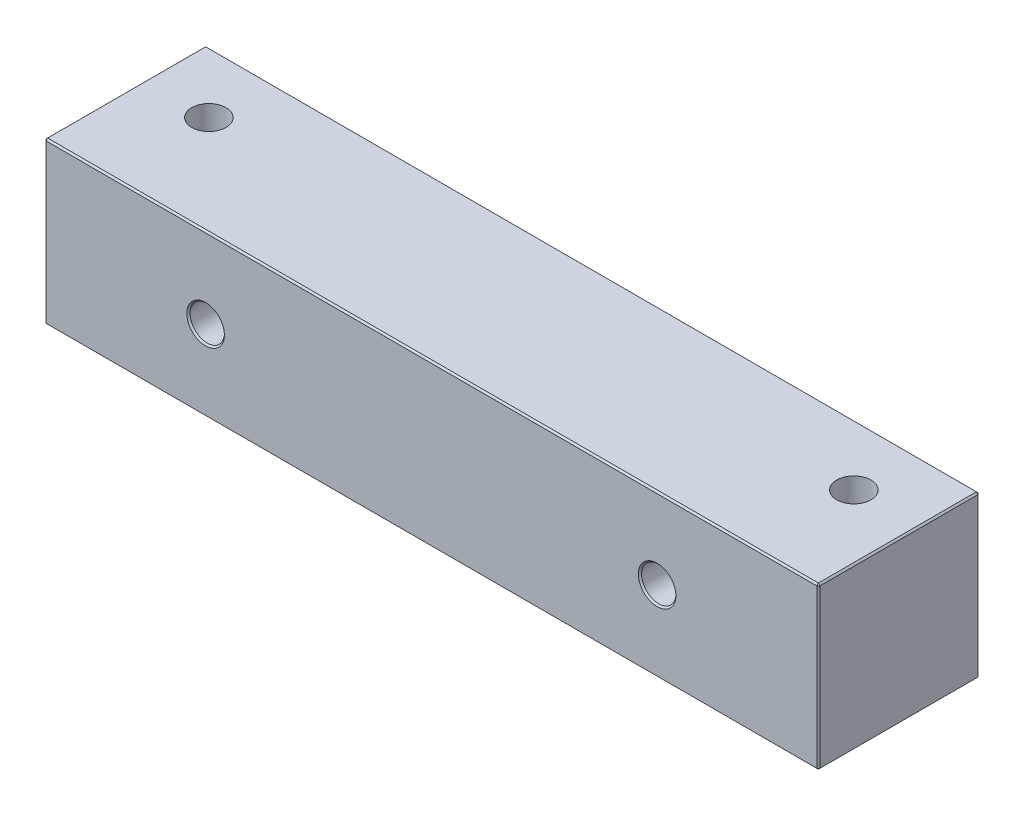
ISO-10303-21;
HEADER;
FILE_DESCRIPTION(('STEP AP214'),'2;1');
FILE_NAME('part.step','',(''),(''),'','','');
FILE_SCHEMA(('AUTOMOTIVE_DESIGN { 1 0 10303 214 1 1 1 1 }'));
ENDSEC;
DATA;
#1=APPLICATION_CONTEXT('core data for automotive mechanical design processes');
#2=APPLICATION_PROTOCOL_DEFINITION('international standard','automotive_design',2000,#1);
#3=PRODUCT_CONTEXT('',#1,'mechanical');
#4=PRODUCT('Part','Part','',(#3));
#5=PRODUCT_RELATED_PRODUCT_CATEGORY('part','',(#4));
#6=PRODUCT_DEFINITION_FORMATION('','',#4);
#7=PRODUCT_DEFINITION_CONTEXT('part definition',#1,'design');
#8=PRODUCT_DEFINITION('design','',#6,#7);
#9=PRODUCT_DEFINITION_SHAPE('','',#8);
#10=(LENGTH_UNIT() NAMED_UNIT(*) SI_UNIT(.MILLI.,.METRE.));
#11=(NAMED_UNIT(*) PLANE_ANGLE_UNIT() SI_UNIT($,.RADIAN.));
#12=(NAMED_UNIT(*) SI_UNIT($,.STERADIAN.) SOLID_ANGLE_UNIT());
#13=UNCERTAINTY_MEASURE_WITH_UNIT(LENGTH_MEASURE(1.E-05),#10,'distance_accuracy_value','');
#14=(GEOMETRIC_REPRESENTATION_CONTEXT(3) GLOBAL_UNCERTAINTY_ASSIGNED_CONTEXT((#13)) GLOBAL_UNIT_ASSIGNED_CONTEXT((#10,
#11,#12)) REPRESENTATION_CONTEXT('',''));
#15=CARTESIAN_POINT('',(0.,0.,0.));
#16=DIRECTION('',(0.,0.,1.));
#17=DIRECTION('',(1.,0.,0.));
#18=AXIS2_PLACEMENT_3D('',#15,#16,#17);
#19=CARTESIAN_POINT('',(30.48,6.35,-6.35));
#20=DIRECTION('',(-1.,0.,0.));
#21=DIRECTION('',(0.,0.,1.));
#22=AXIS2_PLACEMENT_3D('',#19,#20,#21);
#23=PLANE('',#22);
#24=DIRECTION('',(0.,0.,-1.));
#25=VECTOR('',#24,1.);
#26=CARTESIAN_POINT('',(30.48,-6.223,-6.35));
#27=LINE('',#26,#25);
#28=CARTESIAN_POINT('',(30.48,-6.223,6.223));
#29=VERTEX_POINT('',#28);
#30=CARTESIAN_POINT('',(30.48,-6.223,-6.223));
#31=VERTEX_POINT('',#30);
#32=EDGE_CURVE('E208',#29,#31,#27,.T.);
#33=ORIENTED_EDGE('',*,*,#32,.T.);
#34=DIRECTION('',(0.,1.,0.));
#35=VECTOR('',#34,1.);
#36=CARTESIAN_POINT('',(30.48,6.35,-6.223));
#37=LINE('',#36,#35);
#38=CARTESIAN_POINT('',(30.48,6.223,-6.223));
#39=VERTEX_POINT('',#38);
#40=EDGE_CURVE('E146',#31,#39,#37,.T.);
#41=ORIENTED_EDGE('',*,*,#40,.T.);
#42=DIRECTION('',(0.,0.,1.));
#43=VECTOR('',#42,1.);
#44=CARTESIAN_POINT('',(30.48,6.223,6.35));
#45=LINE('',#44,#43);
#46=CARTESIAN_POINT('',(30.48,6.223,6.223));
#47=VERTEX_POINT('',#46);
#48=EDGE_CURVE('E210',#39,#47,#45,.T.);
#49=ORIENTED_EDGE('',*,*,#48,.T.);
#50=DIRECTION('',(0.,-1.,0.));
#51=VECTOR('',#50,1.);
#52=CARTESIAN_POINT('',(30.48,6.35,6.223));
#53=LINE('',#52,#51);
#54=EDGE_CURVE('E206',#47,#29,#53,.T.);
#55=ORIENTED_EDGE('',*,*,#54,.T.);
#56=EDGE_LOOP('',(#33,#41,#49,#55));
#57=FACE_BOUND('',#56,.T.);
#58=ADVANCED_FACE('F50',(#57),#23,.F.);
#59=CARTESIAN_POINT('',(-30.48,6.35,-6.35));
#60=DIRECTION('',(0.,0.,1.));
#61=DIRECTION('',(1.,0.,0.));
#62=AXIS2_PLACEMENT_3D('',#59,#60,#61);
#63=PLANE('',#62);
#64=CARTESIAN_POINT('',(17.78,0.,-6.35));
#65=DIRECTION('',(0.,0.,1.));
#66=DIRECTION('',(1.,0.,0.));
#67=AXIS2_PLACEMENT_3D('',#64,#65,#66);
#68=CIRCLE('',#67,1.47955);
#69=CARTESIAN_POINT('',(19.25955,0.,-6.35));
#70=VERTEX_POINT('',#69);
#71=EDGE_CURVE('E178',#70,#70,#68,.T.);
#72=ORIENTED_EDGE('',*,*,#71,.T.);
#73=EDGE_LOOP('',(#72));
#74=FACE_BOUND('',#73,.T.);
#75=CARTESIAN_POINT('',(-17.78,0.,-6.35));
#76=DIRECTION('',(0.,0.,1.));
#77=DIRECTION('',(1.,0.,0.));
#78=AXIS2_PLACEMENT_3D('',#75,#76,#77);
#79=CIRCLE('',#78,1.47955000000002);
#80=CARTESIAN_POINT('',(-16.30045,0.,-6.35));
#81=VERTEX_POINT('',#80);
#82=EDGE_CURVE('E175',#81,#81,#79,.T.);
#83=ORIENTED_EDGE('',*,*,#82,.T.);
#84=EDGE_LOOP('',(#83));
#85=FACE_BOUND('',#84,.T.);
#86=DIRECTION('',(1.,0.,0.));
#87=VECTOR('',#86,1.);
#88=CARTESIAN_POINT('',(30.48,6.223,-6.35));
#89=LINE('',#88,#87);
#90=CARTESIAN_POINT('',(-30.353,6.223,-6.35));
#91=VERTEX_POINT('',#90);
#92=CARTESIAN_POINT('',(30.353,6.223,-6.35));
#93=VERTEX_POINT('',#92);
#94=EDGE_CURVE('E174',#91,#93,#89,.T.);
#95=ORIENTED_EDGE('',*,*,#94,.T.);
#96=DIRECTION('',(0.,-1.,0.));
#97=VECTOR('',#96,1.);
#98=CARTESIAN_POINT('',(30.353,6.35,-6.35));
#99=LINE('',#98,#97);
#100=CARTESIAN_POINT('',(30.353,-6.223,-6.35));
#101=VERTEX_POINT('',#100);
#102=EDGE_CURVE('E144',#93,#101,#99,.T.);
#103=ORIENTED_EDGE('',*,*,#102,.T.);
#104=DIRECTION('',(-1.,0.,0.));
#105=VECTOR('',#104,1.);
#106=CARTESIAN_POINT('',(-30.48,-6.223,-6.35));
#107=LINE('',#106,#105);
#108=CARTESIAN_POINT('',(-30.353,-6.223,-6.35));
#109=VERTEX_POINT('',#108);
#110=EDGE_CURVE('E163',#101,#109,#107,.T.);
#111=ORIENTED_EDGE('',*,*,#110,.T.);
#112=DIRECTION('',(0.,1.,0.));
#113=VECTOR('',#112,1.);
#114=CARTESIAN_POINT('',(-30.353,6.35,-6.35));
#115=LINE('',#114,#113);
#116=EDGE_CURVE('E169',#109,#91,#115,.T.);
#117=ORIENTED_EDGE('',*,*,#116,.T.);
#118=EDGE_LOOP('',(#95,#103,#111,#117));
#119=FACE_BOUND('',#118,.T.);
#120=ADVANCED_FACE('F172',(#74,#85,#119),#63,.F.);
#121=CARTESIAN_POINT('',(-30.48,6.35,-6.35));
#122=DIRECTION('',(1.,0.,0.));
#123=DIRECTION('',(0.,0.,-1.));
#124=AXIS2_PLACEMENT_3D('',#121,#122,#123);
#125=PLANE('',#124);
#126=DIRECTION('',(0.,1.,0.));
#127=VECTOR('',#126,1.);
#128=CARTESIAN_POINT('',(-30.48,6.35,6.223));
#129=LINE('',#128,#127);
#130=CARTESIAN_POINT('',(-30.48,-6.223,6.223));
#131=VERTEX_POINT('',#130);
#132=CARTESIAN_POINT('',(-30.48,6.223,6.223));
#133=VERTEX_POINT('',#132);
#134=EDGE_CURVE('E223',#131,#133,#129,.T.);
#135=ORIENTED_EDGE('',*,*,#134,.T.);
#136=DIRECTION('',(0.,0.,-1.));
#137=VECTOR('',#136,1.);
#138=CARTESIAN_POINT('',(-30.48,6.223,-6.35));
#139=LINE('',#138,#137);
#140=CARTESIAN_POINT('',(-30.48,6.223,-6.223));
#141=VERTEX_POINT('',#140);
#142=EDGE_CURVE('E229',#133,#141,#139,.T.);
#143=ORIENTED_EDGE('',*,*,#142,.T.);
#144=DIRECTION('',(0.,-1.,0.));
#145=VECTOR('',#144,1.);
#146=CARTESIAN_POINT('',(-30.48,6.35,-6.223));
#147=LINE('',#146,#145);
#148=CARTESIAN_POINT('',(-30.48,-6.223,-6.223));
#149=VERTEX_POINT('',#148);
#150=EDGE_CURVE('E227',#141,#149,#147,.T.);
#151=ORIENTED_EDGE('',*,*,#150,.T.);
#152=DIRECTION('',(0.,0.,1.));
#153=VECTOR('',#152,1.);
#154=CARTESIAN_POINT('',(-30.48,-6.223,-6.35));
#155=LINE('',#154,#153);
#156=EDGE_CURVE('E225',#149,#131,#155,.T.);
#157=ORIENTED_EDGE('',*,*,#156,.T.);
#158=EDGE_LOOP('',(#135,#143,#151,#157));
#159=FACE_BOUND('',#158,.T.);
#160=ADVANCED_FACE('F365',(#159),#125,.F.);
#161=CARTESIAN_POINT('',(-30.48,6.35,6.35));
#162=DIRECTION('',(0.,0.,-1.));
#163=DIRECTION('',(-1.,0.,0.));
#164=AXIS2_PLACEMENT_3D('',#161,#162,#163);
#165=PLANE('',#164);
#166=DIRECTION('',(-1.,0.,0.));
#167=VECTOR('',#166,1.);
#168=CARTESIAN_POINT('',(-30.48,6.223,6.35));
#169=LINE('',#168,#167);
#170=CARTESIAN_POINT('',(30.353,6.223,6.35));
#171=VERTEX_POINT('',#170);
#172=CARTESIAN_POINT('',(-30.353,6.223,6.35));
#173=VERTEX_POINT('',#172);
#174=EDGE_CURVE('E59',#171,#173,#169,.T.);
#175=ORIENTED_EDGE('',*,*,#174,.T.);
#176=DIRECTION('',(0.,-1.,0.));
#177=VECTOR('',#176,1.);
#178=CARTESIAN_POINT('',(-30.353,6.35,6.35));
#179=LINE('',#178,#177);
#180=CARTESIAN_POINT('',(-30.353,-6.223,6.35));
#181=VERTEX_POINT('',#180);
#182=EDGE_CURVE('E13',#173,#181,#179,.T.);
#183=ORIENTED_EDGE('',*,*,#182,.T.);
#184=DIRECTION('',(1.,0.,0.));
#185=VECTOR('',#184,1.);
#186=CARTESIAN_POINT('',(-30.48,-6.223,6.35));
#187=LINE('',#186,#185);
#188=CARTESIAN_POINT('',(30.353,-6.223,6.35));
#189=VERTEX_POINT('',#188);
#190=EDGE_CURVE('E238',#181,#189,#187,.T.);
#191=ORIENTED_EDGE('',*,*,#190,.T.);
#192=DIRECTION('',(0.,1.,0.));
#193=VECTOR('',#192,1.);
#194=CARTESIAN_POINT('',(30.353,6.35,6.35));
#195=LINE('',#194,#193);
#196=EDGE_CURVE('E70',#189,#171,#195,.T.);
#197=ORIENTED_EDGE('',*,*,#196,.T.);
#198=EDGE_LOOP('',(#175,#183,#191,#197));
#199=FACE_BOUND('',#198,.T.);
#200=CARTESIAN_POINT('',(17.78,0.,6.35));
#201=DIRECTION('',(0.,0.,-1.));
#202=DIRECTION('',(-1.,0.,0.));
#203=AXIS2_PLACEMENT_3D('',#200,#201,#202);
#204=CIRCLE('',#203,1.47954999999998);
#205=CARTESIAN_POINT('',(16.30045,0.,6.35));
#206=VERTEX_POINT('',#205);
#207=EDGE_CURVE('E235',#206,#206,#204,.T.);
#208=ORIENTED_EDGE('',*,*,#207,.T.);
#209=EDGE_LOOP('',(#208));
#210=FACE_BOUND('',#209,.T.);
#211=CARTESIAN_POINT('',(-17.78,0.,6.35));
#212=DIRECTION('',(0.,0.,-1.));
#213=DIRECTION('',(-1.,0.,0.));
#214=AXIS2_PLACEMENT_3D('',#211,#212,#213);
#215=CIRCLE('',#214,1.47955);
#216=CARTESIAN_POINT('',(-19.25955,0.,6.35));
#217=VERTEX_POINT('',#216);
#218=EDGE_CURVE('E232',#217,#217,#215,.T.);
#219=ORIENTED_EDGE('',*,*,#218,.T.);
#220=EDGE_LOOP('',(#219));
#221=FACE_BOUND('',#220,.T.);
#222=ADVANCED_FACE('F428',(#199,#210,#221),#165,.F.);
#223=CARTESIAN_POINT('',(0.,6.35,0.));
#224=DIRECTION('',(0.,1.,0.));
#225=DIRECTION('',(0.,0.,1.));
#226=AXIS2_PLACEMENT_3D('',#223,#224,#225);
#227=PLANE('',#226);
#228=DIRECTION('',(0.,0.,-1.));
#229=VECTOR('',#228,1.);
#230=CARTESIAN_POINT('',(30.353,6.35,-6.35));
#231=LINE('',#230,#229);
#232=CARTESIAN_POINT('',(30.353,6.35,6.223));
#233=VERTEX_POINT('',#232);
#234=CARTESIAN_POINT('',(30.353,6.35,-6.223));
#235=VERTEX_POINT('',#234);
#236=EDGE_CURVE('E201',#233,#235,#231,.T.);
#237=ORIENTED_EDGE('',*,*,#236,.T.);
#238=DIRECTION('',(-1.,0.,0.));
#239=VECTOR('',#238,1.);
#240=CARTESIAN_POINT('',(-30.48,6.35,-6.223));
#241=LINE('',#240,#239);
#242=CARTESIAN_POINT('',(-30.353,6.35,-6.223));
#243=VERTEX_POINT('',#242);
#244=EDGE_CURVE('E204',#235,#243,#241,.T.);
#245=ORIENTED_EDGE('',*,*,#244,.T.);
#246=DIRECTION('',(0.,0.,1.));
#247=VECTOR('',#246,1.);
#248=CARTESIAN_POINT('',(-30.353,6.35,6.35));
#249=LINE('',#248,#247);
#250=CARTESIAN_POINT('',(-30.353,6.35,6.223));
#251=VERTEX_POINT('',#250);
#252=EDGE_CURVE('E199',#243,#251,#249,.T.);
#253=ORIENTED_EDGE('',*,*,#252,.T.);
#254=DIRECTION('',(1.,0.,0.));
#255=VECTOR('',#254,1.);
#256=CARTESIAN_POINT('',(30.48,6.35,6.223));
#257=LINE('',#256,#255);
#258=EDGE_CURVE('E197',#251,#233,#257,.T.);
#259=ORIENTED_EDGE('',*,*,#258,.T.);
#260=EDGE_LOOP('',(#237,#245,#253,#259));
#261=FACE_BOUND('',#260,.T.);
#262=CARTESIAN_POINT('',(-25.4,6.35,-1.524));
#263=DIRECTION('',(0.,1.,0.));
#264=DIRECTION('',(0.,0.,1.));
#265=AXIS2_PLACEMENT_3D('',#262,#263,#264);
#266=CIRCLE('',#265,1.35254999999999);
#267=CARTESIAN_POINT('',(-25.4,6.35,-0.171450000000013));
#268=VERTEX_POINT('',#267);
#269=EDGE_CURVE('E295',#268,#268,#266,.T.);
#270=ORIENTED_EDGE('',*,*,#269,.F.);
#271=EDGE_LOOP('',(#270));
#272=FACE_BOUND('',#271,.T.);
#273=CARTESIAN_POINT('',(25.4,6.35,-1.52400000000002));
#274=DIRECTION('',(0.,1.,0.));
#275=DIRECTION('',(0.,0.,1.));
#276=AXIS2_PLACEMENT_3D('',#273,#274,#275);
#277=CIRCLE('',#276,1.35254999999999);
#278=CARTESIAN_POINT('',(25.4,6.35,-0.171450000000037));
#279=VERTEX_POINT('',#278);
#280=EDGE_CURVE('E306',#279,#279,#277,.T.);
#281=ORIENTED_EDGE('',*,*,#280,.F.);
#282=EDGE_LOOP('',(#281));
#283=FACE_BOUND('',#282,.T.);
#284=ADVANCED_FACE('F444',(#261,#272,#283),#227,.T.);
#285=CARTESIAN_POINT('',(0.,-6.35,0.));
#286=DIRECTION('',(0.,1.,0.));
#287=DIRECTION('',(0.,0.,1.));
#288=AXIS2_PLACEMENT_3D('',#285,#286,#287);
#289=PLANE('',#288);
#290=DIRECTION('',(1.,0.,0.));
#291=VECTOR('',#290,1.);
#292=CARTESIAN_POINT('',(0.,-6.35,-6.223));
#293=LINE('',#292,#291);
#294=CARTESIAN_POINT('',(-30.353,-6.35,-6.223));
#295=VERTEX_POINT('',#294);
#296=CARTESIAN_POINT('',(30.353,-6.35,-6.223));
#297=VERTEX_POINT('',#296);
#298=EDGE_CURVE('E218',#295,#297,#293,.T.);
#299=ORIENTED_EDGE('',*,*,#298,.T.);
#300=DIRECTION('',(0.,0.,1.));
#301=VECTOR('',#300,1.);
#302=CARTESIAN_POINT('',(30.353,-6.35,0.));
#303=LINE('',#302,#301);
#304=CARTESIAN_POINT('',(30.353,-6.35,6.223));
#305=VERTEX_POINT('',#304);
#306=EDGE_CURVE('E220',#297,#305,#303,.T.);
#307=ORIENTED_EDGE('',*,*,#306,.T.);
#308=DIRECTION('',(-1.,0.,0.));
#309=VECTOR('',#308,1.);
#310=CARTESIAN_POINT('',(0.,-6.35,6.223));
#311=LINE('',#310,#309);
#312=CARTESIAN_POINT('',(-30.353,-6.35,6.223));
#313=VERTEX_POINT('',#312);
#314=EDGE_CURVE('E214',#305,#313,#311,.T.);
#315=ORIENTED_EDGE('',*,*,#314,.T.);
#316=DIRECTION('',(0.,0.,-1.));
#317=VECTOR('',#316,1.);
#318=CARTESIAN_POINT('',(-30.353,-6.35,0.));
#319=LINE('',#318,#317);
#320=EDGE_CURVE('E216',#313,#295,#319,.T.);
#321=ORIENTED_EDGE('',*,*,#320,.T.);
#322=EDGE_LOOP('',(#299,#307,#315,#321));
#323=FACE_BOUND('',#322,.T.);
#324=CARTESIAN_POINT('',(-25.4,-6.35,-1.524));
#325=DIRECTION('',(0.,1.,0.));
#326=DIRECTION('',(0.,0.,1.));
#327=AXIS2_PLACEMENT_3D('',#324,#325,#326);
#328=CIRCLE('',#327,1.35254999999999);
#329=CARTESIAN_POINT('',(-25.4,-6.35,-0.171450000000013));
#330=VERTEX_POINT('',#329);
#331=EDGE_CURVE('E301',#330,#330,#328,.T.);
#332=ORIENTED_EDGE('',*,*,#331,.T.);
#333=EDGE_LOOP('',(#332));
#334=FACE_BOUND('',#333,.T.);
#335=CARTESIAN_POINT('',(25.4,-6.35,-1.52400000000002));
#336=DIRECTION('',(0.,1.,0.));
#337=DIRECTION('',(0.,0.,1.));
#338=AXIS2_PLACEMENT_3D('',#335,#336,#337);
#339=CIRCLE('',#338,1.35254999999999);
#340=CARTESIAN_POINT('',(25.4,-6.35,-0.171450000000037));
#341=VERTEX_POINT('',#340);
#342=EDGE_CURVE('E170',#341,#341,#339,.T.);
#343=ORIENTED_EDGE('',*,*,#342,.T.);
#344=EDGE_LOOP('',(#343));
#345=FACE_BOUND('',#344,.T.);
#346=ADVANCED_FACE('F341',(#323,#334,#345),#289,.F.);
#347=CARTESIAN_POINT('',(25.4,6.35,-1.52400000000002));
#348=DIRECTION('',(0.,1.,0.));
#349=DIRECTION('',(0.,0.,1.));
#350=AXIS2_PLACEMENT_3D('',#347,#348,#349);
#351=CYLINDRICAL_SURFACE('',#350,1.35254999999999);
#352=ORIENTED_EDGE('',*,*,#342,.F.);
#353=EDGE_LOOP('',(#352));
#354=FACE_BOUND('',#353,.T.);
#355=ORIENTED_EDGE('',*,*,#280,.T.);
#356=EDGE_LOOP('',(#355));
#357=FACE_BOUND('',#356,.T.);
#358=ADVANCED_FACE('F449',(#354,#357),#351,.F.);
#359=CARTESIAN_POINT('',(-25.4,6.35,-1.524));
#360=DIRECTION('',(0.,1.,0.));
#361=DIRECTION('',(0.,0.,1.));
#362=AXIS2_PLACEMENT_3D('',#359,#360,#361);
#363=CYLINDRICAL_SURFACE('',#362,1.35254999999999);
#364=ORIENTED_EDGE('',*,*,#331,.F.);
#365=EDGE_LOOP('',(#364));
#366=FACE_BOUND('',#365,.T.);
#367=ORIENTED_EDGE('',*,*,#269,.T.);
#368=EDGE_LOOP('',(#367));
#369=FACE_BOUND('',#368,.T.);
#370=ADVANCED_FACE('F455',(#366,#369),#363,.F.);
#371=CARTESIAN_POINT('',(17.78,0.,6.35));
#372=DIRECTION('',(0.,0.,1.));
#373=DIRECTION('',(1.,0.,0.));
#374=AXIS2_PLACEMENT_3D('',#371,#372,#373);
#375=CYLINDRICAL_SURFACE('',#374,1.35254999999999);
#376=CARTESIAN_POINT('',(17.78,0.,-6.22299999999999));
#377=DIRECTION('',(0.,0.,1.));
#378=DIRECTION('',(1.,0.,0.));
#379=AXIS2_PLACEMENT_3D('',#376,#377,#378);
#380=CIRCLE('',#379,1.35254999999999);
#381=CARTESIAN_POINT('',(19.13255,0.,-6.22299999999999));
#382=VERTEX_POINT('',#381);
#383=EDGE_CURVE('E188',#382,#382,#380,.F.);
#384=ORIENTED_EDGE('',*,*,#383,.T.);
#385=EDGE_LOOP('',(#384));
#386=FACE_BOUND('',#385,.T.);
#387=CARTESIAN_POINT('',(17.78,0.,6.22300000000002));
#388=DIRECTION('',(0.,0.,-1.));
#389=DIRECTION('',(-1.,0.,0.));
#390=AXIS2_PLACEMENT_3D('',#387,#388,#389);
#391=CIRCLE('',#390,1.35254999999999);
#392=CARTESIAN_POINT('',(16.42745,0.,6.22300000000002));
#393=VERTEX_POINT('',#392);
#394=EDGE_CURVE('E185',#393,#393,#391,.F.);
#395=ORIENTED_EDGE('',*,*,#394,.T.);
#396=EDGE_LOOP('',(#395));
#397=FACE_BOUND('',#396,.T.);
#398=ADVANCED_FACE('F459',(#386,#397),#375,.F.);
#399=CARTESIAN_POINT('',(-17.78,0.,6.35));
#400=DIRECTION('',(0.,0.,1.));
#401=DIRECTION('',(1.,0.,0.));
#402=AXIS2_PLACEMENT_3D('',#399,#400,#401);
#403=CYLINDRICAL_SURFACE('',#402,1.35254999999999);
#404=CARTESIAN_POINT('',(-17.78,0.,-6.22299999999997));
#405=DIRECTION('',(0.,0.,1.));
#406=DIRECTION('',(1.,0.,0.));
#407=AXIS2_PLACEMENT_3D('',#404,#405,#406);
#408=CIRCLE('',#407,1.35254999999999);
#409=CARTESIAN_POINT('',(-16.42745,0.,-6.22299999999997));
#410=VERTEX_POINT('',#409);
#411=EDGE_CURVE('E194',#410,#410,#408,.F.);
#412=ORIENTED_EDGE('',*,*,#411,.T.);
#413=EDGE_LOOP('',(#412));
#414=FACE_BOUND('',#413,.T.);
#415=CARTESIAN_POINT('',(-17.78,0.,6.223));
#416=DIRECTION('',(0.,0.,-1.));
#417=DIRECTION('',(-1.,0.,0.));
#418=AXIS2_PLACEMENT_3D('',#415,#416,#417);
#419=CIRCLE('',#418,1.35254999999999);
#420=CARTESIAN_POINT('',(-19.13255,0.,6.223));
#421=VERTEX_POINT('',#420);
#422=EDGE_CURVE('E191',#421,#421,#419,.F.);
#423=ORIENTED_EDGE('',*,*,#422,.T.);
#424=EDGE_LOOP('',(#423));
#425=FACE_BOUND('',#424,.T.);
#426=ADVANCED_FACE('F374',(#414,#425),#403,.F.);
#427=CARTESIAN_POINT('',(17.78,0.,-6.35));
#428=DIRECTION('',(0.,0.,-1.));
#429=DIRECTION('',(-1.,0.,0.));
#430=AXIS2_PLACEMENT_3D('',#427,#428,#429);
#431=CONICAL_SURFACE('',#430,1.47955,0.785398163397455);
#432=ORIENTED_EDGE('',*,*,#383,.F.);
#433=EDGE_LOOP('',(#432));
#434=FACE_BOUND('',#433,.T.);
#435=ORIENTED_EDGE('',*,*,#71,.F.);
#436=EDGE_LOOP('',(#435));
#437=FACE_BOUND('',#436,.T.);
#438=ADVANCED_FACE('F370',(#434,#437),#431,.F.);
#439=CARTESIAN_POINT('',(-17.78,0.,-6.35));
#440=DIRECTION('',(0.,0.,-1.));
#441=DIRECTION('',(-1.,0.,0.));
#442=AXIS2_PLACEMENT_3D('',#439,#440,#441);
#443=CONICAL_SURFACE('',#442,1.47955000000002,0.785398163397455);
#444=ORIENTED_EDGE('',*,*,#411,.F.);
#445=EDGE_LOOP('',(#444));
#446=FACE_BOUND('',#445,.T.);
#447=ORIENTED_EDGE('',*,*,#82,.F.);
#448=EDGE_LOOP('',(#447));
#449=FACE_BOUND('',#448,.T.);
#450=ADVANCED_FACE('F373',(#446,#449),#443,.F.);
#451=CARTESIAN_POINT('',(-30.48,-6.223,-6.35));
#452=DIRECTION('',(0.707106781186547,0.707106781186547,0.));
#453=DIRECTION('',(0.,0.,1.));
#454=AXIS2_PLACEMENT_3D('',#451,#452,#453);
#455=PLANE('',#454);
#456=DIRECTION('',(-0.707106781186547,0.707106781186547,0.));
#457=VECTOR('',#456,1.);
#458=CARTESIAN_POINT('',(-30.48,-6.223,6.223));
#459=LINE('',#458,#457);
#460=EDGE_CURVE('E54',#131,#313,#459,.F.);
#461=ORIENTED_EDGE('',*,*,#460,.F.);
#462=ORIENTED_EDGE('',*,*,#156,.F.);
#463=DIRECTION('',(0.707106781186547,-0.707106781186547,0.));
#464=VECTOR('',#463,1.);
#465=CARTESIAN_POINT('',(-30.48,-6.223,-6.223));
#466=LINE('',#465,#464);
#467=EDGE_CURVE('E290',#295,#149,#466,.F.);
#468=ORIENTED_EDGE('',*,*,#467,.F.);
#469=ORIENTED_EDGE('',*,*,#320,.F.);
#470=EDGE_LOOP('',(#461,#462,#468,#469));
#471=FACE_BOUND('',#470,.T.);
#472=ADVANCED_FACE('F346',(#471),#455,.F.);
#473=CARTESIAN_POINT('',(-30.48,-6.223,6.223));
#474=DIRECTION('',(-0.577350269189626,-0.577350269189626,0.577350269189626));
#475=DIRECTION('',(0.707106781186547,0.,0.707106781186547));
#476=AXIS2_PLACEMENT_3D('',#473,#474,#475);
#477=PLANE('',#476);
#478=DIRECTION('',(0.707106781186547,0.,0.707106781186547));
#479=VECTOR('',#478,1.);
#480=CARTESIAN_POINT('',(-30.48,-6.223,6.223));
#481=LINE('',#480,#479);
#482=EDGE_CURVE('E285',#131,#181,#481,.T.);
#483=ORIENTED_EDGE('',*,*,#482,.F.);
#484=ORIENTED_EDGE('',*,*,#460,.T.);
#485=DIRECTION('',(0.,-0.707106781186547,-0.707106781186547));
#486=VECTOR('',#485,1.);
#487=CARTESIAN_POINT('',(-30.353,-6.2865,6.2865));
#488=LINE('',#487,#486);
#489=EDGE_CURVE('E288',#181,#313,#488,.T.);
#490=ORIENTED_EDGE('',*,*,#489,.F.);
#491=EDGE_LOOP('',(#483,#484,#490));
#492=FACE_BOUND('',#491,.T.);
#493=ADVANCED_FACE('F350',(#492),#477,.T.);
#494=CARTESIAN_POINT('',(-30.48,-6.223,-6.223));
#495=DIRECTION('',(-0.577350269189626,-0.577350269189626,-0.577350269189626));
#496=DIRECTION('',(-0.707106781186547,0.,0.707106781186547));
#497=AXIS2_PLACEMENT_3D('',#494,#495,#496);
#498=PLANE('',#497);
#499=DIRECTION('',(0.,0.707106781186547,-0.707106781186547));
#500=VECTOR('',#499,1.);
#501=CARTESIAN_POINT('',(-30.353,-6.2865,-6.2865));
#502=LINE('',#501,#500);
#503=EDGE_CURVE('E166',#295,#109,#502,.T.);
#504=ORIENTED_EDGE('',*,*,#503,.F.);
#505=ORIENTED_EDGE('',*,*,#467,.T.);
#506=DIRECTION('',(-0.707106781186547,0.,0.707106781186547));
#507=VECTOR('',#506,1.);
#508=CARTESIAN_POINT('',(-30.48,-6.223,-6.223));
#509=LINE('',#508,#507);
#510=EDGE_CURVE('E282',#109,#149,#509,.T.);
#511=ORIENTED_EDGE('',*,*,#510,.F.);
#512=EDGE_LOOP('',(#504,#505,#511));
#513=FACE_BOUND('',#512,.T.);
#514=ADVANCED_FACE('F347',(#513),#498,.T.);
#515=CARTESIAN_POINT('',(-30.48,-6.223,6.35));
#516=DIRECTION('',(0.,0.707106781186547,-0.707106781186547));
#517=DIRECTION('',(1.,0.,0.));
#518=AXIS2_PLACEMENT_3D('',#515,#516,#517);
#519=PLANE('',#518);
#520=ORIENTED_EDGE('',*,*,#489,.T.);
#521=ORIENTED_EDGE('',*,*,#314,.F.);
#522=DIRECTION('',(0.,0.707106781186547,0.707106781186547));
#523=VECTOR('',#522,1.);
#524=CARTESIAN_POINT('',(30.353,-6.35,6.223));
#525=LINE('',#524,#523);
#526=EDGE_CURVE('E276',#189,#305,#525,.F.);
#527=ORIENTED_EDGE('',*,*,#526,.F.);
#528=ORIENTED_EDGE('',*,*,#190,.F.);
#529=EDGE_LOOP('',(#520,#521,#527,#528));
#530=FACE_BOUND('',#529,.T.);
#531=ADVANCED_FACE('F349',(#530),#519,.F.);
#532=CARTESIAN_POINT('',(-30.353,6.35,6.35));
#533=DIRECTION('',(0.707106781186547,0.,-0.707106781186547));
#534=DIRECTION('',(0.,-1.,0.));
#535=AXIS2_PLACEMENT_3D('',#532,#533,#534);
#536=PLANE('',#535);
#537=ORIENTED_EDGE('',*,*,#482,.T.);
#538=ORIENTED_EDGE('',*,*,#182,.F.);
#539=DIRECTION('',(-0.707106781186547,0.,-0.707106781186547));
#540=VECTOR('',#539,1.);
#541=CARTESIAN_POINT('',(-30.4165,6.223,6.2865));
#542=LINE('',#541,#540);
#543=EDGE_CURVE('E273',#133,#173,#542,.F.);
#544=ORIENTED_EDGE('',*,*,#543,.F.);
#545=ORIENTED_EDGE('',*,*,#134,.F.);
#546=EDGE_LOOP('',(#537,#538,#544,#545));
#547=FACE_BOUND('',#546,.T.);
#548=ADVANCED_FACE('F356',(#547),#536,.F.);
#549=CARTESIAN_POINT('',(-30.353,6.35,0.));
#550=DIRECTION('',(-0.707106781186547,0.707106781186547,0.));
#551=DIRECTION('',(0.,0.,-1.));
#552=AXIS2_PLACEMENT_3D('',#549,#550,#551);
#553=PLANE('',#552);
#554=DIRECTION('',(0.707106781186547,0.707106781186547,0.));
#555=VECTOR('',#554,1.);
#556=CARTESIAN_POINT('',(-30.48,6.223,-6.223));
#557=LINE('',#556,#555);
#558=EDGE_CURVE('E267',#141,#243,#557,.T.);
#559=ORIENTED_EDGE('',*,*,#558,.F.);
#560=ORIENTED_EDGE('',*,*,#142,.F.);
#561=DIRECTION('',(-0.707106781186547,-0.707106781186547,0.));
#562=VECTOR('',#561,1.);
#563=CARTESIAN_POINT('',(-30.353,6.35,6.223));
#564=LINE('',#563,#562);
#565=EDGE_CURVE('E270',#251,#133,#564,.T.);
#566=ORIENTED_EDGE('',*,*,#565,.F.);
#567=ORIENTED_EDGE('',*,*,#252,.F.);
#568=EDGE_LOOP('',(#559,#560,#566,#567));
#569=FACE_BOUND('',#568,.T.);
#570=ADVANCED_FACE('F418',(#569),#553,.T.);
#571=CARTESIAN_POINT('',(-30.48,6.35,-6.223));
#572=DIRECTION('',(0.707106781186547,0.,0.707106781186547));
#573=DIRECTION('',(0.,-1.,0.));
#574=AXIS2_PLACEMENT_3D('',#571,#572,#573);
#575=PLANE('',#574);
#576=ORIENTED_EDGE('',*,*,#510,.T.);
#577=ORIENTED_EDGE('',*,*,#150,.F.);
#578=DIRECTION('',(0.707106781186547,0.,-0.707106781186547));
#579=VECTOR('',#578,1.);
#580=CARTESIAN_POINT('',(-30.48,6.223,-6.223));
#581=LINE('',#580,#579);
#582=EDGE_CURVE('E160',#91,#141,#581,.F.);
#583=ORIENTED_EDGE('',*,*,#582,.F.);
#584=ORIENTED_EDGE('',*,*,#116,.F.);
#585=EDGE_LOOP('',(#576,#577,#583,#584));
#586=FACE_BOUND('',#585,.T.);
#587=ADVANCED_FACE('F317',(#586),#575,.F.);
#588=CARTESIAN_POINT('',(-30.48,-6.223,-6.35));
#589=DIRECTION('',(0.,0.707106781186547,0.707106781186547));
#590=DIRECTION('',(-1.,0.,0.));
#591=AXIS2_PLACEMENT_3D('',#588,#589,#590);
#592=PLANE('',#591);
#593=ORIENTED_EDGE('',*,*,#503,.T.);
#594=ORIENTED_EDGE('',*,*,#110,.F.);
#595=DIRECTION('',(0.,-0.707106781186547,0.707106781186547));
#596=VECTOR('',#595,1.);
#597=CARTESIAN_POINT('',(30.353,-6.2865,-6.2865));
#598=LINE('',#597,#596);
#599=EDGE_CURVE('E153',#297,#101,#598,.F.);
#600=ORIENTED_EDGE('',*,*,#599,.F.);
#601=ORIENTED_EDGE('',*,*,#298,.F.);
#602=EDGE_LOOP('',(#593,#594,#600,#601));
#603=FACE_BOUND('',#602,.T.);
#604=ADVANCED_FACE('F164',(#603),#592,.F.);
#605=CARTESIAN_POINT('',(30.48,-6.223,-6.35));
#606=DIRECTION('',(-0.707106781186547,0.707106781186547,0.));
#607=DIRECTION('',(0.,0.,-1.));
#608=AXIS2_PLACEMENT_3D('',#605,#606,#607);
#609=PLANE('',#608);
#610=DIRECTION('',(-0.707106781186547,-0.707106781186547,0.));
#611=VECTOR('',#610,1.);
#612=CARTESIAN_POINT('',(30.353,-6.35,6.223));
#613=LINE('',#612,#611);
#614=EDGE_CURVE('E278',#305,#29,#613,.F.);
#615=ORIENTED_EDGE('',*,*,#614,.F.);
#616=ORIENTED_EDGE('',*,*,#306,.F.);
#617=DIRECTION('',(0.707106781186547,0.707106781186547,0.));
#618=VECTOR('',#617,1.);
#619=CARTESIAN_POINT('',(30.48,-6.223,-6.223));
#620=LINE('',#619,#618);
#621=EDGE_CURVE('E157',#31,#297,#620,.F.);
#622=ORIENTED_EDGE('',*,*,#621,.F.);
#623=ORIENTED_EDGE('',*,*,#32,.F.);
#624=EDGE_LOOP('',(#615,#616,#622,#623));
#625=FACE_BOUND('',#624,.T.);
#626=ADVANCED_FACE('F338',(#625),#609,.F.);
#627=CARTESIAN_POINT('',(30.353,-6.35,6.223));
#628=DIRECTION('',(0.577350269189626,-0.577350269189626,0.577350269189626));
#629=DIRECTION('',(0.707106781186547,0.,-0.707106781186547));
#630=AXIS2_PLACEMENT_3D('',#627,#628,#629);
#631=PLANE('',#630);
#632=ORIENTED_EDGE('',*,*,#526,.T.);
#633=ORIENTED_EDGE('',*,*,#614,.T.);
#634=DIRECTION('',(0.707106781186547,0.,-0.707106781186547));
#635=VECTOR('',#634,1.);
#636=CARTESIAN_POINT('',(30.4165,-6.223,6.2865));
#637=LINE('',#636,#635);
#638=EDGE_CURVE('E262',#189,#29,#637,.T.);
#639=ORIENTED_EDGE('',*,*,#638,.F.);
#640=EDGE_LOOP('',(#632,#633,#639));
#641=FACE_BOUND('',#640,.T.);
#642=ADVANCED_FACE('F407',(#641),#631,.T.);
#643=CARTESIAN_POINT('',(-30.353,6.35,6.223));
#644=DIRECTION('',(-0.577350269189626,0.577350269189626,0.577350269189626));
#645=DIRECTION('',(0.707106781186547,0.,0.707106781186547));
#646=AXIS2_PLACEMENT_3D('',#643,#644,#645);
#647=PLANE('',#646);
#648=ORIENTED_EDGE('',*,*,#565,.T.);
#649=ORIENTED_EDGE('',*,*,#543,.T.);
#650=DIRECTION('',(0.,0.707106781186547,-0.707106781186547));
#651=VECTOR('',#650,1.);
#652=CARTESIAN_POINT('',(-30.353,6.35,6.223));
#653=LINE('',#652,#651);
#654=EDGE_CURVE('E259',#251,#173,#653,.F.);
#655=ORIENTED_EDGE('',*,*,#654,.F.);
#656=EDGE_LOOP('',(#648,#649,#655));
#657=FACE_BOUND('',#656,.T.);
#658=ADVANCED_FACE('F404',(#657),#647,.T.);
#659=CARTESIAN_POINT('',(-30.48,6.223,-6.223));
#660=DIRECTION('',(-0.577350269189626,0.577350269189626,-0.577350269189626));
#661=DIRECTION('',(-0.707106781186547,0.,0.707106781186547));
#662=AXIS2_PLACEMENT_3D('',#659,#660,#661);
#663=PLANE('',#662);
#664=ORIENTED_EDGE('',*,*,#582,.T.);
#665=ORIENTED_EDGE('',*,*,#558,.T.);
#666=DIRECTION('',(0.,-0.707106781186547,-0.707106781186547));
#667=VECTOR('',#666,1.);
#668=CARTESIAN_POINT('',(-30.353,6.2865,-6.2865));
#669=LINE('',#668,#667);
#670=EDGE_CURVE('E149',#91,#243,#669,.F.);
#671=ORIENTED_EDGE('',*,*,#670,.F.);
#672=EDGE_LOOP('',(#664,#665,#671));
#673=FACE_BOUND('',#672,.T.);
#674=ADVANCED_FACE('F320',(#673),#663,.T.);
#675=CARTESIAN_POINT('',(30.48,-6.223,-6.223));
#676=DIRECTION('',(0.577350269189626,-0.577350269189626,-0.577350269189626));
#677=DIRECTION('',(-0.707106781186547,0.,-0.707106781186547));
#678=AXIS2_PLACEMENT_3D('',#675,#676,#677);
#679=PLANE('',#678);
#680=ORIENTED_EDGE('',*,*,#621,.T.);
#681=ORIENTED_EDGE('',*,*,#599,.T.);
#682=DIRECTION('',(-0.707106781186547,0.,-0.707106781186547));
#683=VECTOR('',#682,1.);
#684=CARTESIAN_POINT('',(30.48,-6.223,-6.223));
#685=LINE('',#684,#683);
#686=EDGE_CURVE('E139',#31,#101,#685,.T.);
#687=ORIENTED_EDGE('',*,*,#686,.F.);
#688=EDGE_LOOP('',(#680,#681,#687));
#689=FACE_BOUND('',#688,.T.);
#690=ADVANCED_FACE('F155',(#689),#679,.T.);
#691=CARTESIAN_POINT('',(30.48,6.35,6.223));
#692=DIRECTION('',(-0.707106781186547,0.,-0.707106781186547));
#693=DIRECTION('',(0.,-1.,0.));
#694=AXIS2_PLACEMENT_3D('',#691,#692,#693);
#695=PLANE('',#694);
#696=ORIENTED_EDGE('',*,*,#638,.T.);
#697=ORIENTED_EDGE('',*,*,#54,.F.);
#698=DIRECTION('',(-0.707106781186547,0.,0.707106781186547));
#699=VECTOR('',#698,1.);
#700=CARTESIAN_POINT('',(30.48,6.223,6.223));
#701=LINE('',#700,#699);
#702=EDGE_CURVE('E150',#171,#47,#701,.F.);
#703=ORIENTED_EDGE('',*,*,#702,.F.);
#704=ORIENTED_EDGE('',*,*,#196,.F.);
#705=EDGE_LOOP('',(#696,#697,#703,#704));
#706=FACE_BOUND('',#705,.T.);
#707=ADVANCED_FACE('F395',(#706),#695,.F.);
#708=CARTESIAN_POINT('',(0.,6.35,6.223));
#709=DIRECTION('',(0.,0.707106781186547,0.707106781186547));
#710=DIRECTION('',(-1.,0.,0.));
#711=AXIS2_PLACEMENT_3D('',#708,#709,#710);
#712=PLANE('',#711);
#713=ORIENTED_EDGE('',*,*,#654,.T.);
#714=ORIENTED_EDGE('',*,*,#174,.F.);
#715=DIRECTION('',(0.,-0.707106781186547,0.707106781186547));
#716=VECTOR('',#715,1.);
#717=CARTESIAN_POINT('',(30.353,6.2865,6.2865));
#718=LINE('',#717,#716);
#719=EDGE_CURVE('E252',#233,#171,#718,.T.);
#720=ORIENTED_EDGE('',*,*,#719,.F.);
#721=ORIENTED_EDGE('',*,*,#258,.F.);
#722=EDGE_LOOP('',(#713,#714,#720,#721));
#723=FACE_BOUND('',#722,.T.);
#724=ADVANCED_FACE('F392',(#723),#712,.T.);
#725=CARTESIAN_POINT('',(0.,6.35,-6.223));
#726=DIRECTION('',(0.,0.707106781186547,-0.707106781186547));
#727=DIRECTION('',(1.,0.,0.));
#728=AXIS2_PLACEMENT_3D('',#725,#726,#727);
#729=PLANE('',#728);
#730=ORIENTED_EDGE('',*,*,#670,.T.);
#731=ORIENTED_EDGE('',*,*,#244,.F.);
#732=DIRECTION('',(0.,0.707106781186547,0.707106781186547));
#733=VECTOR('',#732,1.);
#734=CARTESIAN_POINT('',(30.353,6.35,-6.223));
#735=LINE('',#734,#733);
#736=EDGE_CURVE('E249',#93,#235,#735,.T.);
#737=ORIENTED_EDGE('',*,*,#736,.F.);
#738=ORIENTED_EDGE('',*,*,#94,.F.);
#739=EDGE_LOOP('',(#730,#731,#737,#738));
#740=FACE_BOUND('',#739,.T.);
#741=ADVANCED_FACE('F323',(#740),#729,.T.);
#742=CARTESIAN_POINT('',(30.353,6.35,-6.35));
#743=DIRECTION('',(-0.707106781186547,0.,0.707106781186547));
#744=DIRECTION('',(0.,-1.,0.));
#745=AXIS2_PLACEMENT_3D('',#742,#743,#744);
#746=PLANE('',#745);
#747=ORIENTED_EDGE('',*,*,#686,.T.);
#748=ORIENTED_EDGE('',*,*,#102,.F.);
#749=DIRECTION('',(0.707106781186547,0.,0.707106781186547));
#750=VECTOR('',#749,1.);
#751=CARTESIAN_POINT('',(30.4165,6.223,-6.2865));
#752=LINE('',#751,#750);
#753=EDGE_CURVE('E246',#39,#93,#752,.F.);
#754=ORIENTED_EDGE('',*,*,#753,.F.);
#755=ORIENTED_EDGE('',*,*,#40,.F.);
#756=EDGE_LOOP('',(#747,#748,#754,#755));
#757=FACE_BOUND('',#756,.T.);
#758=ADVANCED_FACE('F141',(#757),#746,.F.);
#759=CARTESIAN_POINT('',(30.48,6.223,6.223));
#760=DIRECTION('',(0.577350269189626,0.577350269189626,0.577350269189626));
#761=DIRECTION('',(0.707106781186547,0.,-0.707106781186547));
#762=AXIS2_PLACEMENT_3D('',#759,#760,#761);
#763=PLANE('',#762);
#764=ORIENTED_EDGE('',*,*,#719,.T.);
#765=ORIENTED_EDGE('',*,*,#702,.T.);
#766=DIRECTION('',(-0.707106781186547,0.707106781186547,0.));
#767=VECTOR('',#766,1.);
#768=CARTESIAN_POINT('',(30.48,6.223,6.223));
#769=LINE('',#768,#767);
#770=EDGE_CURVE('E244',#233,#47,#769,.F.);
#771=ORIENTED_EDGE('',*,*,#770,.F.);
#772=EDGE_LOOP('',(#764,#765,#771));
#773=FACE_BOUND('',#772,.T.);
#774=ADVANCED_FACE('F384',(#773),#763,.T.);
#775=CARTESIAN_POINT('',(30.353,6.35,-6.223));
#776=DIRECTION('',(0.577350269189626,0.577350269189626,-0.577350269189626));
#777=DIRECTION('',(-0.707106781186547,0.,-0.707106781186547));
#778=AXIS2_PLACEMENT_3D('',#775,#776,#777);
#779=PLANE('',#778);
#780=ORIENTED_EDGE('',*,*,#753,.T.);
#781=ORIENTED_EDGE('',*,*,#736,.T.);
#782=DIRECTION('',(0.707106781186547,-0.707106781186547,0.));
#783=VECTOR('',#782,1.);
#784=CARTESIAN_POINT('',(30.353,6.35,-6.223));
#785=LINE('',#784,#783);
#786=EDGE_CURVE('E242',#39,#235,#785,.F.);
#787=ORIENTED_EDGE('',*,*,#786,.F.);
#788=EDGE_LOOP('',(#780,#781,#787));
#789=FACE_BOUND('',#788,.T.);
#790=ADVANCED_FACE('F326',(#789),#779,.T.);
#791=CARTESIAN_POINT('',(30.353,6.35,0.));
#792=DIRECTION('',(0.707106781186547,0.707106781186547,0.));
#793=DIRECTION('',(0.,0.,1.));
#794=AXIS2_PLACEMENT_3D('',#791,#792,#793);
#795=PLANE('',#794);
#796=ORIENTED_EDGE('',*,*,#770,.T.);
#797=ORIENTED_EDGE('',*,*,#48,.F.);
#798=ORIENTED_EDGE('',*,*,#786,.T.);
#799=ORIENTED_EDGE('',*,*,#236,.F.);
#800=EDGE_LOOP('',(#796,#797,#798,#799));
#801=FACE_BOUND('',#800,.T.);
#802=ADVANCED_FACE('F329',(#801),#795,.T.);
#803=CARTESIAN_POINT('',(17.78,0.,6.22300000000002));
#804=DIRECTION('',(0.,0.,1.));
#805=DIRECTION('',(1.,0.,0.));
#806=AXIS2_PLACEMENT_3D('',#803,#804,#805);
#807=CONICAL_SURFACE('',#806,1.35254999999999,0.785398163397448);
#808=ORIENTED_EDGE('',*,*,#207,.F.);
#809=EDGE_LOOP('',(#808));
#810=FACE_BOUND('',#809,.T.);
#811=ORIENTED_EDGE('',*,*,#394,.F.);
#812=EDGE_LOOP('',(#811));
#813=FACE_BOUND('',#812,.T.);
#814=ADVANCED_FACE('F381',(#810,#813),#807,.F.);
#815=CARTESIAN_POINT('',(-17.78,0.,6.223));
#816=DIRECTION('',(0.,0.,1.));
#817=DIRECTION('',(1.,0.,0.));
#818=AXIS2_PLACEMENT_3D('',#815,#816,#817);
#819=CONICAL_SURFACE('',#818,1.35254999999999,0.785398163397448);
#820=ORIENTED_EDGE('',*,*,#218,.F.);
#821=EDGE_LOOP('',(#820));
#822=FACE_BOUND('',#821,.T.);
#823=ORIENTED_EDGE('',*,*,#422,.F.);
#824=EDGE_LOOP('',(#823));
#825=FACE_BOUND('',#824,.T.);
#826=ADVANCED_FACE('F52',(#822,#825),#819,.F.);
#827=CLOSED_SHELL('',(#58,#120,#160,#222,#284,#346,#358,#370,#398,#426,#438,#450,#472,#493,#514,
#531,#548,#570,#587,#604,#626,#642,#658,#674,#690,#707,#724,#741,#758,#774,#790,#802,#814,#826));
#828=MANIFOLD_SOLID_BREP('B2',#827);
#829=ADVANCED_BREP_SHAPE_REPRESENTATION('',(#18,#828),#14);
#830=SHAPE_DEFINITION_REPRESENTATION(#9,#829);
ENDSEC;
END-ISO-10303-21;
